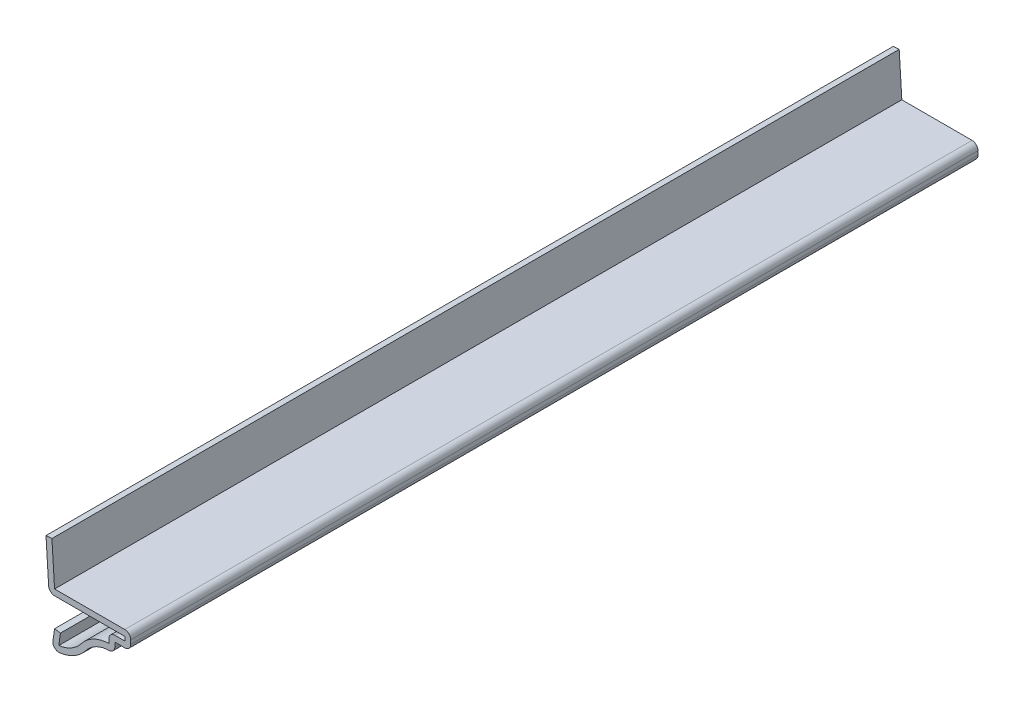
ISO-10303-21;
HEADER;
FILE_DESCRIPTION(('STEP AP214'),'2;1');
FILE_NAME('part.step','',(''),(''),'','','');
FILE_SCHEMA(('AUTOMOTIVE_DESIGN { 1 0 10303 214 1 1 1 1 }'));
ENDSEC;
DATA;
#1=APPLICATION_CONTEXT('core data for automotive mechanical design processes');
#2=APPLICATION_PROTOCOL_DEFINITION('international standard','automotive_design',2000,#1);
#3=PRODUCT_CONTEXT('',#1,'mechanical');
#4=PRODUCT('Part','Part','',(#3));
#5=PRODUCT_RELATED_PRODUCT_CATEGORY('part','',(#4));
#6=PRODUCT_DEFINITION_FORMATION('','',#4);
#7=PRODUCT_DEFINITION_CONTEXT('part definition',#1,'design');
#8=PRODUCT_DEFINITION('design','',#6,#7);
#9=PRODUCT_DEFINITION_SHAPE('','',#8);
#10=(LENGTH_UNIT() NAMED_UNIT(*) SI_UNIT(.MILLI.,.METRE.));
#11=(NAMED_UNIT(*) PLANE_ANGLE_UNIT() SI_UNIT($,.RADIAN.));
#12=(NAMED_UNIT(*) SI_UNIT($,.STERADIAN.) SOLID_ANGLE_UNIT());
#13=UNCERTAINTY_MEASURE_WITH_UNIT(LENGTH_MEASURE(1.E-05),#10,'distance_accuracy_value','');
#14=(GEOMETRIC_REPRESENTATION_CONTEXT(3) GLOBAL_UNCERTAINTY_ASSIGNED_CONTEXT((#13)) GLOBAL_UNIT_ASSIGNED_CONTEXT((#10,
#11,#12)) REPRESENTATION_CONTEXT('',''));
#15=CARTESIAN_POINT('',(0.,0.,0.));
#16=DIRECTION('',(0.,0.,1.));
#17=DIRECTION('',(1.,0.,0.));
#18=AXIS2_PLACEMENT_3D('',#15,#16,#17);
#19=CARTESIAN_POINT('',(0.880065099864777,-0.125723585694968,-127.));
#20=DIRECTION('',(0.989949493661166,-0.14142135623731,0.));
#21=DIRECTION('',(0.14142135623731,0.989949493661167,0.));
#22=AXIS2_PLACEMENT_3D('',#19,#20,#21);
#23=PLANE('',#22);
#24=DIRECTION('',(0.14142135623731,0.989949493661167,0.));
#25=VECTOR('',#24,1.);
#26=CARTESIAN_POINT('',(0.880065099864777,-0.125723585694968,0.));
#27=LINE('',#26,#25);
#28=CARTESIAN_POINT('',(1.02878797558419,0.915336544340929,0.));
#29=VERTEX_POINT('',#28);
#30=CARTESIAN_POINT('',(1.27694009986478,2.65240141430503,0.));
#31=VERTEX_POINT('',#30);
#32=EDGE_CURVE('E265',#29,#31,#27,.T.);
#33=ORIENTED_EDGE('',*,*,#32,.F.);
#34=DIRECTION('',(0.,0.,1.));
#35=VECTOR('',#34,1.);
#36=CARTESIAN_POINT('',(1.02878797558419,0.915336544340929,-127.));
#37=LINE('',#36,#35);
#38=CARTESIAN_POINT('',(1.02878797558419,0.915336544340929,-127.));
#39=VERTEX_POINT('',#38);
#40=EDGE_CURVE('E222',#39,#29,#37,.T.);
#41=ORIENTED_EDGE('',*,*,#40,.F.);
#42=DIRECTION('',(0.14142135623731,0.989949493661167,0.));
#43=VECTOR('',#42,1.);
#44=CARTESIAN_POINT('',(0.880065099864777,-0.125723585694968,-127.));
#45=LINE('',#44,#43);
#46=CARTESIAN_POINT('',(1.27694009986478,2.65240141430503,-127.));
#47=VERTEX_POINT('',#46);
#48=EDGE_CURVE('E204',#39,#47,#45,.T.);
#49=ORIENTED_EDGE('',*,*,#48,.T.);
#50=DIRECTION('',(0.,0.,1.));
#51=VECTOR('',#50,1.);
#52=CARTESIAN_POINT('',(1.27694009986478,2.65240141430503,-127.));
#53=LINE('',#52,#51);
#54=EDGE_CURVE('E212',#47,#31,#53,.T.);
#55=ORIENTED_EDGE('',*,*,#54,.T.);
#56=EDGE_LOOP('',(#33,#41,#49,#55));
#57=FACE_BOUND('',#56,.T.);
#58=ADVANCED_FACE('F37',(#57),#23,.T.);
#59=CARTESIAN_POINT('',(0.396875,5.93988110150363,-127.));
#60=DIRECTION('',(0.,0.,1.));
#61=DIRECTION('',(1.,0.,0.));
#62=AXIS2_PLACEMENT_3D('',#59,#60,#61);
#63=CYLINDRICAL_SURFACE('',#62,5.064125);
#64=CARTESIAN_POINT('',(0.396875,5.93988110150363,0.));
#65=DIRECTION('',(0.,0.,1.));
#66=DIRECTION('',(1.,0.,0.));
#67=AXIS2_PLACEMENT_3D('',#64,#65,#66);
#68=CIRCLE('',#67,5.064125);
#69=CARTESIAN_POINT('',(4.40867639344028,2.84944236319873,0.));
#70=VERTEX_POINT('',#69);
#71=EDGE_CURVE('E223',#70,#29,#68,.F.);
#72=ORIENTED_EDGE('',*,*,#71,.F.);
#73=DIRECTION('',(0.,0.,1.));
#74=VECTOR('',#73,1.);
#75=CARTESIAN_POINT('',(4.40867639344028,2.84944236319873,-127.));
#76=LINE('',#75,#74);
#77=CARTESIAN_POINT('',(4.40867639344028,2.84944236319873,-127.));
#78=VERTEX_POINT('',#77);
#79=EDGE_CURVE('E306',#78,#70,#76,.T.);
#80=ORIENTED_EDGE('',*,*,#79,.F.);
#81=CARTESIAN_POINT('',(0.396875,5.93988110150363,-127.));
#82=DIRECTION('',(0.,0.,1.));
#83=DIRECTION('',(1.,0.,0.));
#84=AXIS2_PLACEMENT_3D('',#81,#82,#83);
#85=CIRCLE('',#84,5.064125);
#86=EDGE_CURVE('E220',#78,#39,#85,.F.);
#87=ORIENTED_EDGE('',*,*,#86,.T.);
#88=ORIENTED_EDGE('',*,*,#40,.T.);
#89=EDGE_LOOP('',(#72,#80,#87,#88));
#90=FACE_BOUND('',#89,.T.);
#91=ADVANCED_FACE('F430',(#90),#63,.F.);
#92=CARTESIAN_POINT('',(8.636,-0.407021093448059,-127.));
#93=DIRECTION('',(0.,0.,1.));
#94=DIRECTION('',(1.,0.,0.));
#95=AXIS2_PLACEMENT_3D('',#92,#93,#94);
#96=CYLINDRICAL_SURFACE('',#95,5.33618019926735);
#97=CARTESIAN_POINT('',(8.636,-0.407021093448059,0.));
#98=DIRECTION('',(0.,0.,1.));
#99=DIRECTION('',(1.,0.,0.));
#100=AXIS2_PLACEMENT_3D('',#97,#98,#99);
#101=CIRCLE('',#100,5.33618019926735);
#102=CARTESIAN_POINT('',(8.54075,4.92830893913221,0.));
#103=VERTEX_POINT('',#102);
#104=EDGE_CURVE('E226',#103,#70,#101,.T.);
#105=ORIENTED_EDGE('',*,*,#104,.F.);
#106=DIRECTION('',(0.,0.,1.));
#107=VECTOR('',#106,1.);
#108=CARTESIAN_POINT('',(8.54075,4.92830893913221,-127.));
#109=LINE('',#108,#107);
#110=CARTESIAN_POINT('',(8.54075,4.92830893913221,-127.));
#111=VERTEX_POINT('',#110);
#112=EDGE_CURVE('E308',#111,#103,#109,.T.);
#113=ORIENTED_EDGE('',*,*,#112,.F.);
#114=CARTESIAN_POINT('',(8.636,-0.407021093448059,-127.));
#115=DIRECTION('',(0.,0.,1.));
#116=DIRECTION('',(1.,0.,0.));
#117=AXIS2_PLACEMENT_3D('',#114,#115,#116);
#118=CIRCLE('',#117,5.33618019926735);
#119=EDGE_CURVE('E261',#111,#78,#118,.T.);
#120=ORIENTED_EDGE('',*,*,#119,.T.);
#121=ORIENTED_EDGE('',*,*,#79,.T.);
#122=EDGE_LOOP('',(#105,#113,#120,#121));
#123=FACE_BOUND('',#122,.T.);
#124=ADVANCED_FACE('F427',(#123),#96,.T.);
#125=CARTESIAN_POINT('',(8.54075,5.55625,-127.));
#126=DIRECTION('',(-1.,0.,0.));
#127=DIRECTION('',(0.,0.,1.));
#128=AXIS2_PLACEMENT_3D('',#125,#126,#127);
#129=PLANE('',#128);
#130=DIRECTION('',(0.,1.,0.));
#131=VECTOR('',#130,1.);
#132=CARTESIAN_POINT('',(8.54075,5.55625,0.));
#133=LINE('',#132,#131);
#134=CARTESIAN_POINT('',(8.54075,5.55625,0.));
#135=VERTEX_POINT('',#134);
#136=EDGE_CURVE('E300',#135,#103,#133,.F.);
#137=ORIENTED_EDGE('',*,*,#136,.F.);
#138=DIRECTION('',(0.,0.,1.));
#139=VECTOR('',#138,1.);
#140=CARTESIAN_POINT('',(8.54075,5.55625,-127.));
#141=LINE('',#140,#139);
#142=CARTESIAN_POINT('',(8.54075,5.55625,-127.));
#143=VERTEX_POINT('',#142);
#144=EDGE_CURVE('E366',#135,#143,#141,.F.);
#145=ORIENTED_EDGE('',*,*,#144,.T.);
#146=DIRECTION('',(0.,1.,0.));
#147=VECTOR('',#146,1.);
#148=CARTESIAN_POINT('',(8.54075,5.55625,-127.));
#149=LINE('',#148,#147);
#150=EDGE_CURVE('E259',#143,#111,#149,.F.);
#151=ORIENTED_EDGE('',*,*,#150,.T.);
#152=ORIENTED_EDGE('',*,*,#112,.T.);
#153=EDGE_LOOP('',(#137,#145,#151,#152));
#154=FACE_BOUND('',#153,.T.);
#155=ADVANCED_FACE('F421',(#154),#129,.T.);
#156=CARTESIAN_POINT('',(11.811,6.44525,-127.));
#157=DIRECTION('',(0.,1.,0.));
#158=DIRECTION('',(0.,0.,1.));
#159=AXIS2_PLACEMENT_3D('',#156,#157,#158);
#160=PLANE('',#159);
#161=DIRECTION('',(1.,0.,0.));
#162=VECTOR('',#161,1.);
#163=CARTESIAN_POINT('',(11.811,6.44525,-127.));
#164=LINE('',#163,#162);
#165=CARTESIAN_POINT('',(10.922,6.44525,-127.));
#166=VERTEX_POINT('',#165);
#167=CARTESIAN_POINT('',(9.42975,6.44525,-127.));
#168=VERTEX_POINT('',#167);
#169=EDGE_CURVE('E256',#166,#168,#164,.F.);
#170=ORIENTED_EDGE('',*,*,#169,.T.);
#171=DIRECTION('',(0.,0.,1.));
#172=VECTOR('',#171,1.);
#173=CARTESIAN_POINT('',(9.42975,6.44525,-127.));
#174=LINE('',#173,#172);
#175=CARTESIAN_POINT('',(9.42975,6.44525,0.));
#176=VERTEX_POINT('',#175);
#177=EDGE_CURVE('E363',#168,#176,#174,.T.);
#178=ORIENTED_EDGE('',*,*,#177,.T.);
#179=DIRECTION('',(1.,0.,0.));
#180=VECTOR('',#179,1.);
#181=CARTESIAN_POINT('',(11.811,6.44525,0.));
#182=LINE('',#181,#180);
#183=CARTESIAN_POINT('',(10.922,6.44525,0.));
#184=VERTEX_POINT('',#183);
#185=EDGE_CURVE('E297',#184,#176,#182,.F.);
#186=ORIENTED_EDGE('',*,*,#185,.F.);
#187=DIRECTION('',(0.,0.,1.));
#188=VECTOR('',#187,1.);
#189=CARTESIAN_POINT('',(10.922,6.44525,-127.));
#190=LINE('',#189,#188);
#191=EDGE_CURVE('E311',#166,#184,#190,.T.);
#192=ORIENTED_EDGE('',*,*,#191,.F.);
#193=EDGE_LOOP('',(#170,#178,#186,#192));
#194=FACE_BOUND('',#193,.T.);
#195=ADVANCED_FACE('F413',(#194),#160,.T.);
#196=CARTESIAN_POINT('',(10.922,7.9375,-127.));
#197=DIRECTION('',(-1.,0.,0.));
#198=DIRECTION('',(0.,-1.,0.));
#199=AXIS2_PLACEMENT_3D('',#196,#197,#198);
#200=PLANE('',#199);
#201=DIRECTION('',(0.,-1.,0.));
#202=VECTOR('',#201,1.);
#203=CARTESIAN_POINT('',(10.922,7.9375,0.));
#204=LINE('',#203,#202);
#205=CARTESIAN_POINT('',(10.922,7.0485,0.));
#206=VERTEX_POINT('',#205);
#207=EDGE_CURVE('E294',#206,#184,#204,.T.);
#208=ORIENTED_EDGE('',*,*,#207,.F.);
#209=DIRECTION('',(0.,0.,1.));
#210=VECTOR('',#209,1.);
#211=CARTESIAN_POINT('',(10.922,7.0485,-127.));
#212=LINE('',#211,#210);
#213=CARTESIAN_POINT('',(10.922,7.0485,-127.));
#214=VERTEX_POINT('',#213);
#215=EDGE_CURVE('E313',#214,#206,#212,.T.);
#216=ORIENTED_EDGE('',*,*,#215,.F.);
#217=DIRECTION('',(0.,-1.,0.));
#218=VECTOR('',#217,1.);
#219=CARTESIAN_POINT('',(10.922,7.9375,-127.));
#220=LINE('',#219,#218);
#221=EDGE_CURVE('E253',#214,#166,#220,.T.);
#222=ORIENTED_EDGE('',*,*,#221,.T.);
#223=ORIENTED_EDGE('',*,*,#191,.T.);
#224=EDGE_LOOP('',(#208,#216,#222,#223));
#225=FACE_BOUND('',#224,.T.);
#226=ADVANCED_FACE('F410',(#225),#200,.T.);
#227=CARTESIAN_POINT('',(0.396875,7.0485,-127.));
#228=DIRECTION('',(0.,-1.,0.));
#229=DIRECTION('',(0.,0.,-1.));
#230=AXIS2_PLACEMENT_3D('',#227,#228,#229);
#231=PLANE('',#230);
#232=DIRECTION('',(1.,0.,0.));
#233=VECTOR('',#232,1.);
#234=CARTESIAN_POINT('',(0.396875,7.0485,0.));
#235=LINE('',#234,#233);
#236=CARTESIAN_POINT('',(0.396875,7.0485,0.));
#237=VERTEX_POINT('',#236);
#238=EDGE_CURVE('E292',#237,#206,#235,.T.);
#239=ORIENTED_EDGE('',*,*,#238,.F.);
#240=DIRECTION('',(0.,0.,1.));
#241=VECTOR('',#240,1.);
#242=CARTESIAN_POINT('',(0.396875,7.0485,-127.));
#243=LINE('',#242,#241);
#244=CARTESIAN_POINT('',(0.396875,7.0485,-127.));
#245=VERTEX_POINT('',#244);
#246=EDGE_CURVE('E11',#237,#245,#243,.F.);
#247=ORIENTED_EDGE('',*,*,#246,.T.);
#248=DIRECTION('',(1.,0.,0.));
#249=VECTOR('',#248,1.);
#250=CARTESIAN_POINT('',(0.396875,7.0485,-127.));
#251=LINE('',#250,#249);
#252=EDGE_CURVE('E251',#245,#214,#251,.T.);
#253=ORIENTED_EDGE('',*,*,#252,.T.);
#254=ORIENTED_EDGE('',*,*,#215,.T.);
#255=EDGE_LOOP('',(#239,#247,#253,#254));
#256=FACE_BOUND('',#255,.T.);
#257=ADVANCED_FACE('F405',(#256),#231,.T.);
#258=CARTESIAN_POINT('',(-0.887268742271288,14.232045703608,-127.));
#259=DIRECTION('',(-0.998052578482889,-0.0623782861551805,0.));
#260=DIRECTION('',(0.0623782861551805,-0.998052578482889,0.));
#261=AXIS2_PLACEMENT_3D('',#258,#259,#260);
#262=PLANE('',#261);
#263=DIRECTION('',(0.0623782861551805,-0.998052578482889,0.));
#264=VECTOR('',#263,1.);
#265=CARTESIAN_POINT('',(-0.887268742271288,14.232045703608,-127.));
#266=LINE('',#265,#264);
#267=CARTESIAN_POINT('',(-0.887268742271288,14.232045703608,-127.));
#268=VERTEX_POINT('',#267);
#269=CARTESIAN_POINT('',(-0.490393742271288,7.88204570360804,-127.));
#270=VERTEX_POINT('',#269);
#271=EDGE_CURVE('E248',#268,#270,#266,.T.);
#272=ORIENTED_EDGE('',*,*,#271,.T.);
#273=DIRECTION('',(0.,0.,1.));
#274=VECTOR('',#273,1.);
#275=CARTESIAN_POINT('',(-0.490393742271288,7.88204570360804,-127.));
#276=LINE('',#275,#274);
#277=CARTESIAN_POINT('',(-0.490393742271288,7.88204570360804,0.));
#278=VERTEX_POINT('',#277);
#279=EDGE_CURVE('E45',#270,#278,#276,.T.);
#280=ORIENTED_EDGE('',*,*,#279,.T.);
#281=DIRECTION('',(0.0623782861551805,-0.998052578482889,0.));
#282=VECTOR('',#281,1.);
#283=CARTESIAN_POINT('',(-0.887268742271288,14.232045703608,0.));
#284=LINE('',#283,#282);
#285=CARTESIAN_POINT('',(-0.887268742271288,14.232045703608,0.));
#286=VERTEX_POINT('',#285);
#287=EDGE_CURVE('E289',#286,#278,#284,.T.);
#288=ORIENTED_EDGE('',*,*,#287,.F.);
#289=DIRECTION('',(0.,0.,1.));
#290=VECTOR('',#289,1.);
#291=CARTESIAN_POINT('',(-0.887268742271288,14.232045703608,-127.));
#292=LINE('',#291,#290);
#293=EDGE_CURVE('E316',#268,#286,#292,.T.);
#294=ORIENTED_EDGE('',*,*,#293,.F.);
#295=EDGE_LOOP('',(#272,#280,#288,#294));
#296=FACE_BOUND('',#295,.T.);
#297=ADVANCED_FACE('F380',(#296),#262,.T.);
#298=CARTESIAN_POINT('',(-0.887268742271288,14.232045703608,-127.));
#299=DIRECTION('',(0.0623782861551811,-0.998052578482889,0.));
#300=DIRECTION('',(0.998052578482889,0.0623782861551811,0.));
#301=AXIS2_PLACEMENT_3D('',#298,#299,#300);
#302=PLANE('',#301);
#303=DIRECTION('',(0.998052578482889,0.0623782861551811,0.));
#304=VECTOR('',#303,1.);
#305=CARTESIAN_POINT('',(-0.887268742271288,14.232045703608,0.));
#306=LINE('',#305,#304);
#307=CARTESIAN_POINT('',(0.,14.2875,0.));
#308=VERTEX_POINT('',#307);
#309=EDGE_CURVE('E287',#286,#308,#306,.T.);
#310=ORIENTED_EDGE('',*,*,#309,.T.);
#311=DIRECTION('',(0.,0.,1.));
#312=VECTOR('',#311,1.);
#313=CARTESIAN_POINT('',(0.,14.2875,-127.));
#314=LINE('',#313,#312);
#315=CARTESIAN_POINT('',(0.,14.2875,-127.));
#316=VERTEX_POINT('',#315);
#317=EDGE_CURVE('E318',#316,#308,#314,.T.);
#318=ORIENTED_EDGE('',*,*,#317,.F.);
#319=DIRECTION('',(0.998052578482889,0.0623782861551811,0.));
#320=VECTOR('',#319,1.);
#321=CARTESIAN_POINT('',(-0.887268742271288,14.232045703608,-127.));
#322=LINE('',#321,#320);
#323=EDGE_CURVE('E246',#268,#316,#322,.T.);
#324=ORIENTED_EDGE('',*,*,#323,.F.);
#325=ORIENTED_EDGE('',*,*,#293,.T.);
#326=EDGE_LOOP('',(#310,#318,#324,#325));
#327=FACE_BOUND('',#326,.T.);
#328=ADVANCED_FACE('F393',(#327),#302,.F.);
#329=CARTESIAN_POINT('',(0.,14.2875,-127.));
#330=DIRECTION('',(-0.998052578482889,-0.0623782861551805,0.));
#331=DIRECTION('',(0.0623782861551805,-0.998052578482889,0.));
#332=AXIS2_PLACEMENT_3D('',#329,#330,#331);
#333=PLANE('',#332);
#334=DIRECTION('',(0.0623782861551805,-0.998052578482889,0.));
#335=VECTOR('',#334,1.);
#336=CARTESIAN_POINT('',(0.,14.2875,0.));
#337=LINE('',#336,#335);
#338=CARTESIAN_POINT('',(0.396875,7.9375,0.));
#339=VERTEX_POINT('',#338);
#340=EDGE_CURVE('E285',#308,#339,#337,.T.);
#341=ORIENTED_EDGE('',*,*,#340,.T.);
#342=DIRECTION('',(0.,0.,1.));
#343=VECTOR('',#342,1.);
#344=CARTESIAN_POINT('',(0.396875,7.9375,-127.));
#345=LINE('',#344,#343);
#346=CARTESIAN_POINT('',(0.396875,7.9375,-127.));
#347=VERTEX_POINT('',#346);
#348=EDGE_CURVE('E321',#347,#339,#345,.T.);
#349=ORIENTED_EDGE('',*,*,#348,.F.);
#350=DIRECTION('',(0.0623782861551805,-0.998052578482889,0.));
#351=VECTOR('',#350,1.);
#352=CARTESIAN_POINT('',(0.,14.2875,-127.));
#353=LINE('',#352,#351);
#354=EDGE_CURVE('E244',#316,#347,#353,.T.);
#355=ORIENTED_EDGE('',*,*,#354,.F.);
#356=ORIENTED_EDGE('',*,*,#317,.T.);
#357=EDGE_LOOP('',(#341,#349,#355,#356));
#358=FACE_BOUND('',#357,.T.);
#359=ADVANCED_FACE('F397',(#358),#333,.F.);
#360=CARTESIAN_POINT('',(0.396875,7.9375,-127.));
#361=DIRECTION('',(0.,-1.,0.));
#362=DIRECTION('',(0.,0.,-1.));
#363=AXIS2_PLACEMENT_3D('',#360,#361,#362);
#364=PLANE('',#363);
#365=DIRECTION('',(1.,0.,0.));
#366=VECTOR('',#365,1.);
#367=CARTESIAN_POINT('',(0.396875,7.9375,0.));
#368=LINE('',#367,#366);
#369=CARTESIAN_POINT('',(10.922,7.9375,0.));
#370=VERTEX_POINT('',#369);
#371=EDGE_CURVE('E282',#339,#370,#368,.T.);
#372=ORIENTED_EDGE('',*,*,#371,.T.);
#373=DIRECTION('',(0.,0.,1.));
#374=VECTOR('',#373,1.);
#375=CARTESIAN_POINT('',(10.922,7.9375,-127.));
#376=LINE('',#375,#374);
#377=CARTESIAN_POINT('',(10.922,7.9375,-127.));
#378=VERTEX_POINT('',#377);
#379=EDGE_CURVE('E361',#370,#378,#376,.F.);
#380=ORIENTED_EDGE('',*,*,#379,.T.);
#381=DIRECTION('',(1.,0.,0.));
#382=VECTOR('',#381,1.);
#383=CARTESIAN_POINT('',(0.396875,7.9375,-127.));
#384=LINE('',#383,#382);
#385=EDGE_CURVE('E241',#347,#378,#384,.T.);
#386=ORIENTED_EDGE('',*,*,#385,.F.);
#387=ORIENTED_EDGE('',*,*,#348,.T.);
#388=EDGE_LOOP('',(#372,#380,#386,#387));
#389=FACE_BOUND('',#388,.T.);
#390=ADVANCED_FACE('F568',(#389),#364,.F.);
#391=CARTESIAN_POINT('',(11.811,7.9375,-127.));
#392=DIRECTION('',(-1.,0.,0.));
#393=DIRECTION('',(0.,-1.,0.));
#394=AXIS2_PLACEMENT_3D('',#391,#392,#393);
#395=PLANE('',#394);
#396=DIRECTION('',(0.,-1.,0.));
#397=VECTOR('',#396,1.);
#398=CARTESIAN_POINT('',(11.811,7.9375,0.));
#399=LINE('',#398,#397);
#400=CARTESIAN_POINT('',(11.811,7.0485,0.));
#401=VERTEX_POINT('',#400);
#402=CARTESIAN_POINT('',(11.811,6.44525,0.));
#403=VERTEX_POINT('',#402);
#404=EDGE_CURVE('E279',#401,#403,#399,.T.);
#405=ORIENTED_EDGE('',*,*,#404,.T.);
#406=DIRECTION('',(0.,0.,1.));
#407=VECTOR('',#406,1.);
#408=CARTESIAN_POINT('',(11.811,6.44525,-127.));
#409=LINE('',#408,#407);
#410=CARTESIAN_POINT('',(11.811,6.44525,-127.));
#411=VERTEX_POINT('',#410);
#412=EDGE_CURVE('E348',#403,#411,#409,.F.);
#413=ORIENTED_EDGE('',*,*,#412,.T.);
#414=DIRECTION('',(0.,-1.,0.));
#415=VECTOR('',#414,1.);
#416=CARTESIAN_POINT('',(11.811,7.9375,-127.));
#417=LINE('',#416,#415);
#418=CARTESIAN_POINT('',(11.811,7.0485,-127.));
#419=VERTEX_POINT('',#418);
#420=EDGE_CURVE('E239',#419,#411,#417,.T.);
#421=ORIENTED_EDGE('',*,*,#420,.F.);
#422=DIRECTION('',(0.,0.,1.));
#423=VECTOR('',#422,1.);
#424=CARTESIAN_POINT('',(11.811,7.0485,-127.));
#425=LINE('',#424,#423);
#426=EDGE_CURVE('E345',#419,#401,#425,.T.);
#427=ORIENTED_EDGE('',*,*,#426,.T.);
#428=EDGE_LOOP('',(#405,#413,#421,#427));
#429=FACE_BOUND('',#428,.T.);
#430=ADVANCED_FACE('F559',(#429),#395,.F.);
#431=CARTESIAN_POINT('',(11.811,5.55625,-127.));
#432=DIRECTION('',(0.,1.,0.));
#433=DIRECTION('',(0.,0.,1.));
#434=AXIS2_PLACEMENT_3D('',#431,#432,#433);
#435=PLANE('',#434);
#436=DIRECTION('',(-1.,0.,0.));
#437=VECTOR('',#436,1.);
#438=CARTESIAN_POINT('',(11.811,5.55625,-127.));
#439=LINE('',#438,#437);
#440=CARTESIAN_POINT('',(10.922,5.55625,-127.));
#441=VERTEX_POINT('',#440);
#442=CARTESIAN_POINT('',(9.42975,5.55625,-127.));
#443=VERTEX_POINT('',#442);
#444=EDGE_CURVE('E237',#441,#443,#439,.T.);
#445=ORIENTED_EDGE('',*,*,#444,.F.);
#446=DIRECTION('',(0.,0.,1.));
#447=VECTOR('',#446,1.);
#448=CARTESIAN_POINT('',(10.922,5.55625,-127.));
#449=LINE('',#448,#447);
#450=CARTESIAN_POINT('',(10.922,5.55625,0.));
#451=VERTEX_POINT('',#450);
#452=EDGE_CURVE('E305',#441,#451,#449,.T.);
#453=ORIENTED_EDGE('',*,*,#452,.T.);
#454=DIRECTION('',(-1.,0.,0.));
#455=VECTOR('',#454,1.);
#456=CARTESIAN_POINT('',(11.811,5.55625,0.));
#457=LINE('',#456,#455);
#458=CARTESIAN_POINT('',(9.42975,5.55625,0.));
#459=VERTEX_POINT('',#458);
#460=EDGE_CURVE('E277',#451,#459,#457,.T.);
#461=ORIENTED_EDGE('',*,*,#460,.T.);
#462=DIRECTION('',(0.,0.,1.));
#463=VECTOR('',#462,1.);
#464=CARTESIAN_POINT('',(9.42975,5.55625,-127.));
#465=LINE('',#464,#463);
#466=EDGE_CURVE('E324',#443,#459,#465,.T.);
#467=ORIENTED_EDGE('',*,*,#466,.F.);
#468=EDGE_LOOP('',(#445,#453,#461,#467));
#469=FACE_BOUND('',#468,.T.);
#470=ADVANCED_FACE('F550',(#469),#435,.F.);
#471=CARTESIAN_POINT('',(9.42975,5.55625,-127.));
#472=DIRECTION('',(-1.,0.,0.));
#473=DIRECTION('',(0.,0.,1.));
#474=AXIS2_PLACEMENT_3D('',#471,#472,#473);
#475=PLANE('',#474);
#476=DIRECTION('',(0.,-1.,0.));
#477=VECTOR('',#476,1.);
#478=CARTESIAN_POINT('',(9.42975,5.55625,0.));
#479=LINE('',#478,#477);
#480=CARTESIAN_POINT('',(9.42975,4.92830893913221,0.));
#481=VERTEX_POINT('',#480);
#482=EDGE_CURVE('E274',#459,#481,#479,.T.);
#483=ORIENTED_EDGE('',*,*,#482,.T.);
#484=DIRECTION('',(0.,0.,1.));
#485=VECTOR('',#484,1.);
#486=CARTESIAN_POINT('',(9.42975,4.92830893913221,-127.));
#487=LINE('',#486,#485);
#488=CARTESIAN_POINT('',(9.42975,4.92830893913221,-127.));
#489=VERTEX_POINT('',#488);
#490=EDGE_CURVE('E371',#481,#489,#487,.F.);
#491=ORIENTED_EDGE('',*,*,#490,.T.);
#492=DIRECTION('',(0.,-1.,0.));
#493=VECTOR('',#492,1.);
#494=CARTESIAN_POINT('',(9.42975,5.55625,-127.));
#495=LINE('',#494,#493);
#496=EDGE_CURVE('E234',#443,#489,#495,.T.);
#497=ORIENTED_EDGE('',*,*,#496,.F.);
#498=ORIENTED_EDGE('',*,*,#466,.T.);
#499=EDGE_LOOP('',(#483,#491,#497,#498));
#500=FACE_BOUND('',#499,.T.);
#501=ADVANCED_FACE('F541',(#500),#475,.F.);
#502=CARTESIAN_POINT('',(8.636,-0.407021093448059,-127.));
#503=DIRECTION('',(0.,0.,1.));
#504=DIRECTION('',(1.,0.,0.));
#505=AXIS2_PLACEMENT_3D('',#502,#503,#504);
#506=CYLINDRICAL_SURFACE('',#505,4.44718019926735);
#507=CARTESIAN_POINT('',(8.636,-0.407021093448059,-127.));
#508=DIRECTION('',(0.,0.,1.));
#509=DIRECTION('',(1.,0.,0.));
#510=AXIS2_PLACEMENT_3D('',#507,#508,#509);
#511=CIRCLE('',#510,4.44718019926735);
#512=CARTESIAN_POINT('',(8.55661851396278,4.03945057568806,-127.));
#513=VERTEX_POINT('',#512);
#514=CARTESIAN_POINT('',(5.11294246877776,2.30692020224238,-127.));
#515=VERTEX_POINT('',#514);
#516=EDGE_CURVE('E232',#513,#515,#511,.T.);
#517=ORIENTED_EDGE('',*,*,#516,.F.);
#518=DIRECTION('',(0.,0.,1.));
#519=VECTOR('',#518,1.);
#520=CARTESIAN_POINT('',(8.55661851396278,4.03945057568806,-127.));
#521=LINE('',#520,#519);
#522=CARTESIAN_POINT('',(8.55661851396278,4.03945057568806,0.));
#523=VERTEX_POINT('',#522);
#524=EDGE_CURVE('E368',#513,#523,#521,.T.);
#525=ORIENTED_EDGE('',*,*,#524,.T.);
#526=CARTESIAN_POINT('',(8.636,-0.407021093448059,0.));
#527=DIRECTION('',(0.,0.,1.));
#528=DIRECTION('',(1.,0.,0.));
#529=AXIS2_PLACEMENT_3D('',#526,#527,#528);
#530=CIRCLE('',#529,4.44718019926735);
#531=CARTESIAN_POINT('',(5.11294246877776,2.30692020224238,0.));
#532=VERTEX_POINT('',#531);
#533=EDGE_CURVE('E272',#523,#532,#530,.T.);
#534=ORIENTED_EDGE('',*,*,#533,.T.);
#535=DIRECTION('',(0.,0.,1.));
#536=VECTOR('',#535,1.);
#537=CARTESIAN_POINT('',(5.11294246877776,2.30692020224238,-127.));
#538=LINE('',#537,#536);
#539=EDGE_CURVE('E327',#515,#532,#538,.T.);
#540=ORIENTED_EDGE('',*,*,#539,.F.);
#541=EDGE_LOOP('',(#517,#525,#534,#540));
#542=FACE_BOUND('',#541,.T.);
#543=ADVANCED_FACE('F533',(#542),#506,.F.);
#544=CARTESIAN_POINT('',(0.396875,5.93988110150363,-127.));
#545=DIRECTION('',(0.,0.,1.));
#546=DIRECTION('',(1.,0.,0.));
#547=AXIS2_PLACEMENT_3D('',#544,#545,#546);
#548=CYLINDRICAL_SURFACE('',#547,5.953125);
#549=CARTESIAN_POINT('',(0.396875,5.93988110150363,0.));
#550=DIRECTION('',(0.,0.,-1.));
#551=DIRECTION('',(-1.,0.,0.));
#552=AXIS2_PLACEMENT_3D('',#549,#550,#551);
#553=CIRCLE('',#552,5.953125);
#554=CARTESIAN_POINT('',(1.13971940703471,0.0332848352465375,0.));
#555=VERTEX_POINT('',#554);
#556=EDGE_CURVE('E270',#532,#555,#553,.T.);
#557=ORIENTED_EDGE('',*,*,#556,.T.);
#558=DIRECTION('',(0.,0.,1.));
#559=VECTOR('',#558,1.);
#560=CARTESIAN_POINT('',(1.13971940703471,0.0332848352465357,-127.));
#561=LINE('',#560,#559);
#562=CARTESIAN_POINT('',(1.13971940703471,0.0332848352465375,-127.));
#563=VERTEX_POINT('',#562);
#564=EDGE_CURVE('E60',#555,#563,#561,.F.);
#565=ORIENTED_EDGE('',*,*,#564,.T.);
#566=CARTESIAN_POINT('',(0.396875,5.93988110150363,-127.));
#567=DIRECTION('',(0.,0.,-1.));
#568=DIRECTION('',(-1.,0.,0.));
#569=AXIS2_PLACEMENT_3D('',#566,#567,#568);
#570=CIRCLE('',#569,5.953125);
#571=EDGE_CURVE('E230',#515,#563,#570,.T.);
#572=ORIENTED_EDGE('',*,*,#571,.F.);
#573=ORIENTED_EDGE('',*,*,#539,.T.);
#574=EDGE_LOOP('',(#557,#565,#572,#573));
#575=FACE_BOUND('',#574,.T.);
#576=ADVANCED_FACE('F526',(#575),#548,.T.);
#577=CARTESIAN_POINT('',(0.,0.,-127.));
#578=DIRECTION('',(0.989949493661166,-0.14142135623731,0.));
#579=DIRECTION('',(0.14142135623731,0.989949493661167,0.));
#580=AXIS2_PLACEMENT_3D('',#577,#578,#579);
#581=PLANE('',#580);
#582=DIRECTION('',(0.14142135623731,0.989949493661167,0.));
#583=VECTOR('',#582,1.);
#584=CARTESIAN_POINT('',(0.,0.,-127.));
#585=LINE('',#584,#583);
#586=CARTESIAN_POINT('',(0.148722875719414,1.0410601300359,-127.));
#587=VERTEX_POINT('',#586);
#588=CARTESIAN_POINT('',(0.396875,2.778125,-127.));
#589=VERTEX_POINT('',#588);
#590=EDGE_CURVE('E206',#587,#589,#585,.T.);
#591=ORIENTED_EDGE('',*,*,#590,.F.);
#592=DIRECTION('',(0.,0.,1.));
#593=VECTOR('',#592,1.);
#594=CARTESIAN_POINT('',(0.148722875719414,1.0410601300359,-127.));
#595=LINE('',#594,#593);
#596=CARTESIAN_POINT('',(0.148722875719414,1.0410601300359,0.));
#597=VERTEX_POINT('',#596);
#598=EDGE_CURVE('E373',#587,#597,#595,.T.);
#599=ORIENTED_EDGE('',*,*,#598,.T.);
#600=DIRECTION('',(0.14142135623731,0.989949493661167,0.));
#601=VECTOR('',#600,1.);
#602=CARTESIAN_POINT('',(0.,0.,0.));
#603=LINE('',#602,#601);
#604=CARTESIAN_POINT('',(0.396875,2.778125,0.));
#605=VERTEX_POINT('',#604);
#606=EDGE_CURVE('E268',#597,#605,#603,.T.);
#607=ORIENTED_EDGE('',*,*,#606,.T.);
#608=DIRECTION('',(0.,0.,1.));
#609=VECTOR('',#608,1.);
#610=CARTESIAN_POINT('',(0.396875,2.778125,-127.));
#611=LINE('',#610,#609);
#612=EDGE_CURVE('E219',#589,#605,#611,.T.);
#613=ORIENTED_EDGE('',*,*,#612,.F.);
#614=EDGE_LOOP('',(#591,#599,#607,#613));
#615=FACE_BOUND('',#614,.T.);
#616=ADVANCED_FACE('F434',(#615),#581,.F.);
#617=CARTESIAN_POINT('',(0.396875,2.778125,-127.));
#618=DIRECTION('',(-0.141421356237308,-0.989949493661167,0.));
#619=DIRECTION('',(0.989949493661167,-0.141421356237308,0.));
#620=AXIS2_PLACEMENT_3D('',#617,#618,#619);
#621=PLANE('',#620);
#622=DIRECTION('',(0.989949493661167,-0.141421356237308,0.));
#623=VECTOR('',#622,1.);
#624=CARTESIAN_POINT('',(0.396875,2.778125,0.));
#625=LINE('',#624,#623);
#626=EDGE_CURVE('E215',#605,#31,#625,.T.);
#627=ORIENTED_EDGE('',*,*,#626,.T.);
#628=ORIENTED_EDGE('',*,*,#54,.F.);
#629=DIRECTION('',(0.989949493661167,-0.141421356237308,0.));
#630=VECTOR('',#629,1.);
#631=CARTESIAN_POINT('',(0.396875,2.778125,-127.));
#632=LINE('',#631,#630);
#633=EDGE_CURVE('E198',#589,#47,#632,.T.);
#634=ORIENTED_EDGE('',*,*,#633,.F.);
#635=ORIENTED_EDGE('',*,*,#612,.T.);
#636=EDGE_LOOP('',(#627,#628,#634,#635));
#637=FACE_BOUND('',#636,.T.);
#638=ADVANCED_FACE('F213',(#637),#621,.F.);
#639=CARTESIAN_POINT('',(0.396875,5.93988110150363,-127.));
#640=DIRECTION('',(0.,0.,-1.));
#641=DIRECTION('',(-1.,0.,0.));
#642=AXIS2_PLACEMENT_3D('',#639,#640,#641);
#643=PLANE('',#642);
#644=ORIENTED_EDGE('',*,*,#420,.T.);
#645=CARTESIAN_POINT('',(10.922,6.44525,-127.));
#646=DIRECTION('',(0.,0.,-1.));
#647=DIRECTION('',(-1.,0.,0.));
#648=AXIS2_PLACEMENT_3D('',#645,#646,#647);
#649=CIRCLE('',#648,0.889);
#650=EDGE_CURVE('E359',#411,#441,#649,.T.);
#651=ORIENTED_EDGE('',*,*,#650,.T.);
#652=ORIENTED_EDGE('',*,*,#444,.T.);
#653=ORIENTED_EDGE('',*,*,#496,.T.);
#654=CARTESIAN_POINT('',(8.54075,4.92830893913221,-127.));
#655=DIRECTION('',(0.,0.,-1.));
#656=DIRECTION('',(-1.,0.,0.));
#657=AXIS2_PLACEMENT_3D('',#654,#655,#656);
#658=CIRCLE('',#657,0.889);
#659=EDGE_CURVE('E353',#489,#513,#658,.T.);
#660=ORIENTED_EDGE('',*,*,#659,.T.);
#661=ORIENTED_EDGE('',*,*,#516,.T.);
#662=ORIENTED_EDGE('',*,*,#571,.T.);
#663=CARTESIAN_POINT('',(1.02878797558419,0.915336544340931,-127.));
#664=DIRECTION('',(0.,0.,-1.));
#665=DIRECTION('',(-1.,0.,0.));
#666=AXIS2_PLACEMENT_3D('',#663,#664,#665);
#667=CIRCLE('',#666,0.889);
#668=EDGE_CURVE('E52',#563,#587,#667,.T.);
#669=ORIENTED_EDGE('',*,*,#668,.T.);
#670=ORIENTED_EDGE('',*,*,#590,.T.);
#671=ORIENTED_EDGE('',*,*,#633,.T.);
#672=ORIENTED_EDGE('',*,*,#48,.F.);
#673=ORIENTED_EDGE('',*,*,#86,.F.);
#674=ORIENTED_EDGE('',*,*,#119,.F.);
#675=ORIENTED_EDGE('',*,*,#150,.F.);
#676=CARTESIAN_POINT('',(9.42975,5.55625,-127.));
#677=DIRECTION('',(0.,0.,-1.));
#678=DIRECTION('',(-1.,0.,0.));
#679=AXIS2_PLACEMENT_3D('',#676,#677,#678);
#680=CIRCLE('',#679,0.889);
#681=EDGE_CURVE('E355',#143,#168,#680,.T.);
#682=ORIENTED_EDGE('',*,*,#681,.T.);
#683=ORIENTED_EDGE('',*,*,#169,.F.);
#684=ORIENTED_EDGE('',*,*,#221,.F.);
#685=ORIENTED_EDGE('',*,*,#252,.F.);
#686=CARTESIAN_POINT('',(0.396875,7.9375,-127.));
#687=DIRECTION('',(0.,0.,-1.));
#688=DIRECTION('',(-1.,0.,0.));
#689=AXIS2_PLACEMENT_3D('',#686,#687,#688);
#690=CIRCLE('',#689,0.889);
#691=EDGE_CURVE('E350',#245,#270,#690,.T.);
#692=ORIENTED_EDGE('',*,*,#691,.T.);
#693=ORIENTED_EDGE('',*,*,#271,.F.);
#694=ORIENTED_EDGE('',*,*,#323,.T.);
#695=ORIENTED_EDGE('',*,*,#354,.T.);
#696=ORIENTED_EDGE('',*,*,#385,.T.);
#697=CARTESIAN_POINT('',(10.922,7.0485,-127.));
#698=DIRECTION('',(0.,0.,-1.));
#699=DIRECTION('',(-1.,0.,0.));
#700=AXIS2_PLACEMENT_3D('',#697,#698,#699);
#701=CIRCLE('',#700,0.889);
#702=EDGE_CURVE('E357',#378,#419,#701,.T.);
#703=ORIENTED_EDGE('',*,*,#702,.T.);
#704=EDGE_LOOP('',(#644,#651,#652,#653,#660,#661,#662,#669,#670,#671,#672,#673,#674,#675,#682,
#683,#684,#685,#692,#693,#694,#695,#696,#703));
#705=FACE_BOUND('',#704,.T.);
#706=ADVANCED_FACE('F201',(#705),#643,.T.);
#707=CARTESIAN_POINT('',(0.396875,5.93988110150363,0.));
#708=DIRECTION('',(0.,0.,-1.));
#709=DIRECTION('',(-1.,0.,0.));
#710=AXIS2_PLACEMENT_3D('',#707,#708,#709);
#711=PLANE('',#710);
#712=ORIENTED_EDGE('',*,*,#460,.F.);
#713=CARTESIAN_POINT('',(10.922,6.44525,0.));
#714=DIRECTION('',(0.,0.,-1.));
#715=DIRECTION('',(-1.,0.,0.));
#716=AXIS2_PLACEMENT_3D('',#713,#714,#715);
#717=CIRCLE('',#716,0.889);
#718=EDGE_CURVE('E343',#451,#403,#717,.F.);
#719=ORIENTED_EDGE('',*,*,#718,.T.);
#720=ORIENTED_EDGE('',*,*,#404,.F.);
#721=CARTESIAN_POINT('',(10.922,7.0485,0.));
#722=DIRECTION('',(0.,0.,-1.));
#723=DIRECTION('',(-1.,0.,0.));
#724=AXIS2_PLACEMENT_3D('',#721,#722,#723);
#725=CIRCLE('',#724,0.889);
#726=EDGE_CURVE('E341',#401,#370,#725,.F.);
#727=ORIENTED_EDGE('',*,*,#726,.T.);
#728=ORIENTED_EDGE('',*,*,#371,.F.);
#729=ORIENTED_EDGE('',*,*,#340,.F.);
#730=ORIENTED_EDGE('',*,*,#309,.F.);
#731=ORIENTED_EDGE('',*,*,#287,.T.);
#732=CARTESIAN_POINT('',(0.396875,7.9375,0.));
#733=DIRECTION('',(0.,0.,-1.));
#734=DIRECTION('',(-1.,0.,0.));
#735=AXIS2_PLACEMENT_3D('',#732,#733,#734);
#736=CIRCLE('',#735,0.889);
#737=EDGE_CURVE('E333',#278,#237,#736,.F.);
#738=ORIENTED_EDGE('',*,*,#737,.T.);
#739=ORIENTED_EDGE('',*,*,#238,.T.);
#740=ORIENTED_EDGE('',*,*,#207,.T.);
#741=ORIENTED_EDGE('',*,*,#185,.T.);
#742=CARTESIAN_POINT('',(9.42975,5.55625,0.));
#743=DIRECTION('',(0.,0.,-1.));
#744=DIRECTION('',(-1.,0.,0.));
#745=AXIS2_PLACEMENT_3D('',#742,#743,#744);
#746=CIRCLE('',#745,0.889);
#747=EDGE_CURVE('E339',#176,#135,#746,.F.);
#748=ORIENTED_EDGE('',*,*,#747,.T.);
#749=ORIENTED_EDGE('',*,*,#136,.T.);
#750=ORIENTED_EDGE('',*,*,#104,.T.);
#751=ORIENTED_EDGE('',*,*,#71,.T.);
#752=ORIENTED_EDGE('',*,*,#32,.T.);
#753=ORIENTED_EDGE('',*,*,#626,.F.);
#754=ORIENTED_EDGE('',*,*,#606,.F.);
#755=CARTESIAN_POINT('',(1.02878797558419,0.915336544340931,0.));
#756=DIRECTION('',(0.,0.,-1.));
#757=DIRECTION('',(-1.,0.,0.));
#758=AXIS2_PLACEMENT_3D('',#755,#756,#757);
#759=CIRCLE('',#758,0.889);
#760=EDGE_CURVE('E335',#597,#555,#759,.F.);
#761=ORIENTED_EDGE('',*,*,#760,.T.);
#762=ORIENTED_EDGE('',*,*,#556,.F.);
#763=ORIENTED_EDGE('',*,*,#533,.F.);
#764=CARTESIAN_POINT('',(8.54075,4.92830893913221,0.));
#765=DIRECTION('',(0.,0.,-1.));
#766=DIRECTION('',(-1.,0.,0.));
#767=AXIS2_PLACEMENT_3D('',#764,#765,#766);
#768=CIRCLE('',#767,0.889);
#769=EDGE_CURVE('E337',#523,#481,#768,.F.);
#770=ORIENTED_EDGE('',*,*,#769,.T.);
#771=ORIENTED_EDGE('',*,*,#482,.F.);
#772=EDGE_LOOP('',(#712,#719,#720,#727,#728,#729,#730,#731,#738,#739,#740,#741,#748,#749,#750,
#751,#752,#753,#754,#761,#762,#763,#770,#771));
#773=FACE_BOUND('',#772,.T.);
#774=ADVANCED_FACE('F387',(#773),#711,.F.);
#775=CARTESIAN_POINT('',(10.922,6.44525,-127.));
#776=DIRECTION('',(0.,0.,1.));
#777=DIRECTION('',(1.,0.,0.));
#778=AXIS2_PLACEMENT_3D('',#775,#776,#777);
#779=CYLINDRICAL_SURFACE('',#778,0.889);
#780=ORIENTED_EDGE('',*,*,#650,.F.);
#781=ORIENTED_EDGE('',*,*,#412,.F.);
#782=ORIENTED_EDGE('',*,*,#718,.F.);
#783=ORIENTED_EDGE('',*,*,#452,.F.);
#784=EDGE_LOOP('',(#780,#781,#782,#783));
#785=FACE_BOUND('',#784,.T.);
#786=ADVANCED_FACE('F455',(#785),#779,.T.);
#787=CARTESIAN_POINT('',(10.922,7.0485,-127.));
#788=DIRECTION('',(0.,0.,1.));
#789=DIRECTION('',(1.,0.,0.));
#790=AXIS2_PLACEMENT_3D('',#787,#788,#789);
#791=CYLINDRICAL_SURFACE('',#790,0.889);
#792=ORIENTED_EDGE('',*,*,#702,.F.);
#793=ORIENTED_EDGE('',*,*,#379,.F.);
#794=ORIENTED_EDGE('',*,*,#726,.F.);
#795=ORIENTED_EDGE('',*,*,#426,.F.);
#796=EDGE_LOOP('',(#792,#793,#794,#795));
#797=FACE_BOUND('',#796,.T.);
#798=ADVANCED_FACE('F458',(#797),#791,.T.);
#799=CARTESIAN_POINT('',(9.42975,5.55625,-127.));
#800=DIRECTION('',(0.,0.,1.));
#801=DIRECTION('',(1.,0.,0.));
#802=AXIS2_PLACEMENT_3D('',#799,#800,#801);
#803=CYLINDRICAL_SURFACE('',#802,0.889);
#804=ORIENTED_EDGE('',*,*,#681,.F.);
#805=ORIENTED_EDGE('',*,*,#144,.F.);
#806=ORIENTED_EDGE('',*,*,#747,.F.);
#807=ORIENTED_EDGE('',*,*,#177,.F.);
#808=EDGE_LOOP('',(#804,#805,#806,#807));
#809=FACE_BOUND('',#808,.T.);
#810=ADVANCED_FACE('F417',(#809),#803,.T.);
#811=CARTESIAN_POINT('',(8.54075,4.92830893913221,-127.));
#812=DIRECTION('',(0.,0.,1.));
#813=DIRECTION('',(1.,0.,0.));
#814=AXIS2_PLACEMENT_3D('',#811,#812,#813);
#815=CYLINDRICAL_SURFACE('',#814,0.889);
#816=ORIENTED_EDGE('',*,*,#659,.F.);
#817=ORIENTED_EDGE('',*,*,#490,.F.);
#818=ORIENTED_EDGE('',*,*,#769,.F.);
#819=ORIENTED_EDGE('',*,*,#524,.F.);
#820=EDGE_LOOP('',(#816,#817,#818,#819));
#821=FACE_BOUND('',#820,.T.);
#822=ADVANCED_FACE('F439',(#821),#815,.T.);
#823=CARTESIAN_POINT('',(1.02878797558419,0.915336544340931,-127.));
#824=DIRECTION('',(0.,0.,1.));
#825=DIRECTION('',(1.,0.,0.));
#826=AXIS2_PLACEMENT_3D('',#823,#824,#825);
#827=CYLINDRICAL_SURFACE('',#826,0.889);
#828=ORIENTED_EDGE('',*,*,#668,.F.);
#829=ORIENTED_EDGE('',*,*,#564,.F.);
#830=ORIENTED_EDGE('',*,*,#760,.F.);
#831=ORIENTED_EDGE('',*,*,#598,.F.);
#832=EDGE_LOOP('',(#828,#829,#830,#831));
#833=FACE_BOUND('',#832,.T.);
#834=ADVANCED_FACE('F437',(#833),#827,.T.);
#835=CARTESIAN_POINT('',(0.396875,7.9375,-127.));
#836=DIRECTION('',(0.,0.,1.));
#837=DIRECTION('',(1.,0.,0.));
#838=AXIS2_PLACEMENT_3D('',#835,#836,#837);
#839=CYLINDRICAL_SURFACE('',#838,0.889);
#840=ORIENTED_EDGE('',*,*,#691,.F.);
#841=ORIENTED_EDGE('',*,*,#246,.F.);
#842=ORIENTED_EDGE('',*,*,#737,.F.);
#843=ORIENTED_EDGE('',*,*,#279,.F.);
#844=EDGE_LOOP('',(#840,#841,#842,#843));
#845=FACE_BOUND('',#844,.T.);
#846=ADVANCED_FACE('F39',(#845),#839,.T.);
#847=CLOSED_SHELL('',(#58,#91,#124,#155,#195,#226,#257,#297,#328,#359,#390,#430,#470,#501,#543,
#576,#616,#638,#706,#774,#786,#798,#810,#822,#834,#846));
#848=MANIFOLD_SOLID_BREP('B2',#847);
#849=ADVANCED_BREP_SHAPE_REPRESENTATION('',(#18,#848),#14);
#850=SHAPE_DEFINITION_REPRESENTATION(#9,#849);
ENDSEC;
END-ISO-10303-21;
